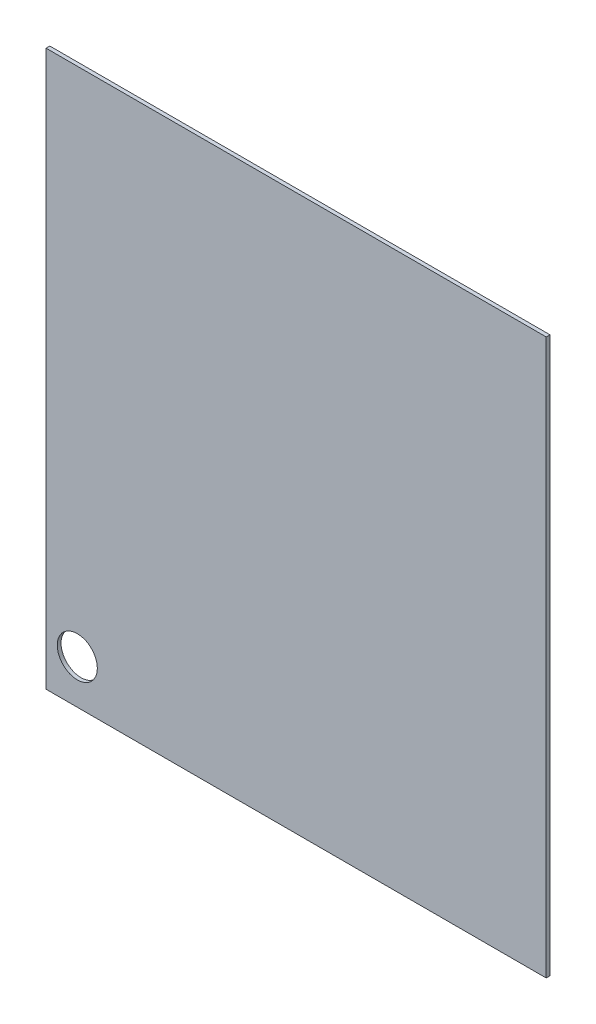
ISO-10303-21;
HEADER;
FILE_DESCRIPTION(('STEP AP214'),'2;1');
FILE_NAME('part.step','',(''),(''),'','','');
FILE_SCHEMA(('AUTOMOTIVE_DESIGN { 1 0 10303 214 1 1 1 1 }'));
ENDSEC;
DATA;
#1=APPLICATION_CONTEXT('core data for automotive mechanical design processes');
#2=APPLICATION_PROTOCOL_DEFINITION('international standard','automotive_design',2000,#1);
#3=PRODUCT_CONTEXT('',#1,'mechanical');
#4=PRODUCT('Part','Part','',(#3));
#5=PRODUCT_RELATED_PRODUCT_CATEGORY('part','',(#4));
#6=PRODUCT_DEFINITION_FORMATION('','',#4);
#7=PRODUCT_DEFINITION_CONTEXT('part definition',#1,'design');
#8=PRODUCT_DEFINITION('design','',#6,#7);
#9=PRODUCT_DEFINITION_SHAPE('','',#8);
#10=(LENGTH_UNIT() NAMED_UNIT(*) SI_UNIT(.MILLI.,.METRE.));
#11=(NAMED_UNIT(*) PLANE_ANGLE_UNIT() SI_UNIT($,.RADIAN.));
#12=(NAMED_UNIT(*) SI_UNIT($,.STERADIAN.) SOLID_ANGLE_UNIT());
#13=UNCERTAINTY_MEASURE_WITH_UNIT(LENGTH_MEASURE(1.E-05),#10,'distance_accuracy_value','');
#14=(GEOMETRIC_REPRESENTATION_CONTEXT(3) GLOBAL_UNCERTAINTY_ASSIGNED_CONTEXT((#13)) GLOBAL_UNIT_ASSIGNED_CONTEXT((#10,
#11,#12)) REPRESENTATION_CONTEXT('',''));
#15=CARTESIAN_POINT('',(0.,0.,0.));
#16=DIRECTION('',(0.,0.,1.));
#17=DIRECTION('',(1.,0.,0.));
#18=AXIS2_PLACEMENT_3D('',#15,#16,#17);
#19=CARTESIAN_POINT('',(0.,0.,3.));
#20=DIRECTION('',(1.,0.,0.));
#21=DIRECTION('',(0.,0.,-1.));
#22=AXIS2_PLACEMENT_3D('',#19,#20,#21);
#23=PLANE('',#22);
#24=DIRECTION('',(0.,-1.,0.));
#25=VECTOR('',#24,1.);
#26=CARTESIAN_POINT('',(0.,0.,3.));
#27=LINE('',#26,#25);
#28=CARTESIAN_POINT('',(0.,444.,3.));
#29=VERTEX_POINT('',#28);
#30=CARTESIAN_POINT('',(0.,0.,3.));
#31=VERTEX_POINT('',#30);
#32=EDGE_CURVE('E88',#29,#31,#27,.T.);
#33=ORIENTED_EDGE('',*,*,#32,.F.);
#34=DIRECTION('',(0.,0.,-1.));
#35=VECTOR('',#34,1.);
#36=CARTESIAN_POINT('',(0.,444.,3.));
#37=LINE('',#36,#35);
#38=CARTESIAN_POINT('',(0.,444.,0.));
#39=VERTEX_POINT('',#38);
#40=EDGE_CURVE('E98',#29,#39,#37,.T.);
#41=ORIENTED_EDGE('',*,*,#40,.T.);
#42=DIRECTION('',(0.,-1.,0.));
#43=VECTOR('',#42,1.);
#44=CARTESIAN_POINT('',(0.,0.,0.));
#45=LINE('',#44,#43);
#46=CARTESIAN_POINT('',(0.,0.,0.));
#47=VERTEX_POINT('',#46);
#48=EDGE_CURVE('E78',#39,#47,#45,.T.);
#49=ORIENTED_EDGE('',*,*,#48,.T.);
#50=DIRECTION('',(0.,0.,-1.));
#51=VECTOR('',#50,1.);
#52=CARTESIAN_POINT('',(0.,0.,3.));
#53=LINE('',#52,#51);
#54=EDGE_CURVE('E11',#31,#47,#53,.T.);
#55=ORIENTED_EDGE('',*,*,#54,.F.);
#56=EDGE_LOOP('',(#33,#41,#49,#55));
#57=FACE_BOUND('',#56,.T.);
#58=ADVANCED_FACE('F33',(#57),#23,.F.);
#59=CARTESIAN_POINT('',(0.,0.,3.));
#60=DIRECTION('',(0.,1.,0.));
#61=DIRECTION('',(0.,0.,1.));
#62=AXIS2_PLACEMENT_3D('',#59,#60,#61);
#63=PLANE('',#62);
#64=DIRECTION('',(1.,0.,0.));
#65=VECTOR('',#64,1.);
#66=CARTESIAN_POINT('',(0.,0.,0.));
#67=LINE('',#66,#65);
#68=CARTESIAN_POINT('',(400.,0.,0.));
#69=VERTEX_POINT('',#68);
#70=EDGE_CURVE('E69',#47,#69,#67,.T.);
#71=ORIENTED_EDGE('',*,*,#70,.T.);
#72=DIRECTION('',(0.,0.,-1.));
#73=VECTOR('',#72,1.);
#74=CARTESIAN_POINT('',(400.,0.,3.));
#75=LINE('',#74,#73);
#76=CARTESIAN_POINT('',(400.,0.,3.));
#77=VERTEX_POINT('',#76);
#78=EDGE_CURVE('E41',#77,#69,#75,.T.);
#79=ORIENTED_EDGE('',*,*,#78,.F.);
#80=DIRECTION('',(1.,0.,0.));
#81=VECTOR('',#80,1.);
#82=CARTESIAN_POINT('',(0.,0.,3.));
#83=LINE('',#82,#81);
#84=EDGE_CURVE('E57',#31,#77,#83,.T.);
#85=ORIENTED_EDGE('',*,*,#84,.F.);
#86=ORIENTED_EDGE('',*,*,#54,.T.);
#87=EDGE_LOOP('',(#71,#79,#85,#86));
#88=FACE_BOUND('',#87,.T.);
#89=ADVANCED_FACE('F71',(#88),#63,.F.);
#90=CARTESIAN_POINT('',(400.,0.,3.));
#91=DIRECTION('',(-1.,0.,0.));
#92=DIRECTION('',(0.,0.,1.));
#93=AXIS2_PLACEMENT_3D('',#90,#91,#92);
#94=PLANE('',#93);
#95=DIRECTION('',(0.,1.,0.));
#96=VECTOR('',#95,1.);
#97=CARTESIAN_POINT('',(400.,0.,0.));
#98=LINE('',#97,#96);
#99=CARTESIAN_POINT('',(400.,444.,0.));
#100=VERTEX_POINT('',#99);
#101=EDGE_CURVE('E77',#69,#100,#98,.T.);
#102=ORIENTED_EDGE('',*,*,#101,.T.);
#103=DIRECTION('',(0.,0.,-1.));
#104=VECTOR('',#103,1.);
#105=CARTESIAN_POINT('',(400.,444.,3.));
#106=LINE('',#105,#104);
#107=CARTESIAN_POINT('',(400.,444.,3.));
#108=VERTEX_POINT('',#107);
#109=EDGE_CURVE('E48',#108,#100,#106,.T.);
#110=ORIENTED_EDGE('',*,*,#109,.F.);
#111=DIRECTION('',(0.,1.,0.));
#112=VECTOR('',#111,1.);
#113=CARTESIAN_POINT('',(400.,0.,3.));
#114=LINE('',#113,#112);
#115=EDGE_CURVE('E83',#77,#108,#114,.T.);
#116=ORIENTED_EDGE('',*,*,#115,.F.);
#117=ORIENTED_EDGE('',*,*,#78,.T.);
#118=EDGE_LOOP('',(#102,#110,#116,#117));
#119=FACE_BOUND('',#118,.T.);
#120=ADVANCED_FACE('F82',(#119),#94,.F.);
#121=CARTESIAN_POINT('',(0.,0.,3.));
#122=DIRECTION('',(0.,0.,-1.));
#123=DIRECTION('',(-1.,0.,0.));
#124=AXIS2_PLACEMENT_3D('',#121,#122,#123);
#125=PLANE('',#124);
#126=CARTESIAN_POINT('',(25.,35.,3.));
#127=DIRECTION('',(0.,0.,1.));
#128=DIRECTION('',(1.,0.,0.));
#129=AXIS2_PLACEMENT_3D('',#126,#127,#128);
#130=CIRCLE('',#129,16.);
#131=CARTESIAN_POINT('',(41.,35.,3.));
#132=VERTEX_POINT('',#131);
#133=EDGE_CURVE('E95',#132,#132,#130,.T.);
#134=ORIENTED_EDGE('',*,*,#133,.F.);
#135=EDGE_LOOP('',(#134));
#136=FACE_BOUND('',#135,.T.);
#137=ORIENTED_EDGE('',*,*,#115,.T.);
#138=DIRECTION('',(-1.,0.,0.));
#139=VECTOR('',#138,1.);
#140=CARTESIAN_POINT('',(0.,444.,3.));
#141=LINE('',#140,#139);
#142=EDGE_CURVE('E100',#108,#29,#141,.T.);
#143=ORIENTED_EDGE('',*,*,#142,.T.);
#144=ORIENTED_EDGE('',*,*,#32,.T.);
#145=ORIENTED_EDGE('',*,*,#84,.T.);
#146=EDGE_LOOP('',(#137,#143,#144,#145));
#147=FACE_BOUND('',#146,.T.);
#148=ADVANCED_FACE('F106',(#136,#147),#125,.F.);
#149=CARTESIAN_POINT('',(0.,0.,0.));
#150=DIRECTION('',(0.,0.,-1.));
#151=DIRECTION('',(-1.,0.,0.));
#152=AXIS2_PLACEMENT_3D('',#149,#150,#151);
#153=PLANE('',#152);
#154=DIRECTION('',(-1.,0.,0.));
#155=VECTOR('',#154,1.);
#156=CARTESIAN_POINT('',(0.,444.,0.));
#157=LINE('',#156,#155);
#158=EDGE_CURVE('E87',#100,#39,#157,.T.);
#159=ORIENTED_EDGE('',*,*,#158,.F.);
#160=ORIENTED_EDGE('',*,*,#101,.F.);
#161=ORIENTED_EDGE('',*,*,#70,.F.);
#162=ORIENTED_EDGE('',*,*,#48,.F.);
#163=EDGE_LOOP('',(#159,#160,#161,#162));
#164=FACE_BOUND('',#163,.T.);
#165=CARTESIAN_POINT('',(25.,35.,0.));
#166=DIRECTION('',(0.,0.,-1.));
#167=DIRECTION('',(-1.,0.,0.));
#168=AXIS2_PLACEMENT_3D('',#165,#166,#167);
#169=CIRCLE('',#168,16.);
#170=CARTESIAN_POINT('',(9.00000000000001,35.,0.));
#171=VERTEX_POINT('',#170);
#172=EDGE_CURVE('E36',#171,#171,#169,.T.);
#173=ORIENTED_EDGE('',*,*,#172,.F.);
#174=EDGE_LOOP('',(#173));
#175=FACE_BOUND('',#174,.T.);
#176=ADVANCED_FACE('F85',(#164,#175),#153,.T.);
#177=CARTESIAN_POINT('',(25.,35.,-7.));
#178=DIRECTION('',(0.,0.,1.));
#179=DIRECTION('',(1.,0.,0.));
#180=AXIS2_PLACEMENT_3D('',#177,#178,#179);
#181=CYLINDRICAL_SURFACE('',#180,16.);
#182=ORIENTED_EDGE('',*,*,#172,.T.);
#183=EDGE_LOOP('',(#182));
#184=FACE_BOUND('',#183,.T.);
#185=ORIENTED_EDGE('',*,*,#133,.T.);
#186=EDGE_LOOP('',(#185));
#187=FACE_BOUND('',#186,.T.);
#188=ADVANCED_FACE('F115',(#184,#187),#181,.F.);
#189=CARTESIAN_POINT('',(0.,444.,3.));
#190=DIRECTION('',(0.,-1.,0.));
#191=DIRECTION('',(1.,0.,0.));
#192=AXIS2_PLACEMENT_3D('',#189,#190,#191);
#193=PLANE('',#192);
#194=ORIENTED_EDGE('',*,*,#158,.T.);
#195=ORIENTED_EDGE('',*,*,#40,.F.);
#196=ORIENTED_EDGE('',*,*,#142,.F.);
#197=ORIENTED_EDGE('',*,*,#109,.T.);
#198=EDGE_LOOP('',(#194,#195,#196,#197));
#199=FACE_BOUND('',#198,.T.);
#200=ADVANCED_FACE('F113',(#199),#193,.F.);
#201=CLOSED_SHELL('',(#58,#89,#120,#148,#176,#188,#200));
#202=MANIFOLD_SOLID_BREP('B2',#201);
#203=ADVANCED_BREP_SHAPE_REPRESENTATION('',(#18,#202),#14);
#204=SHAPE_DEFINITION_REPRESENTATION(#9,#203);
ENDSEC;
END-ISO-10303-21;
